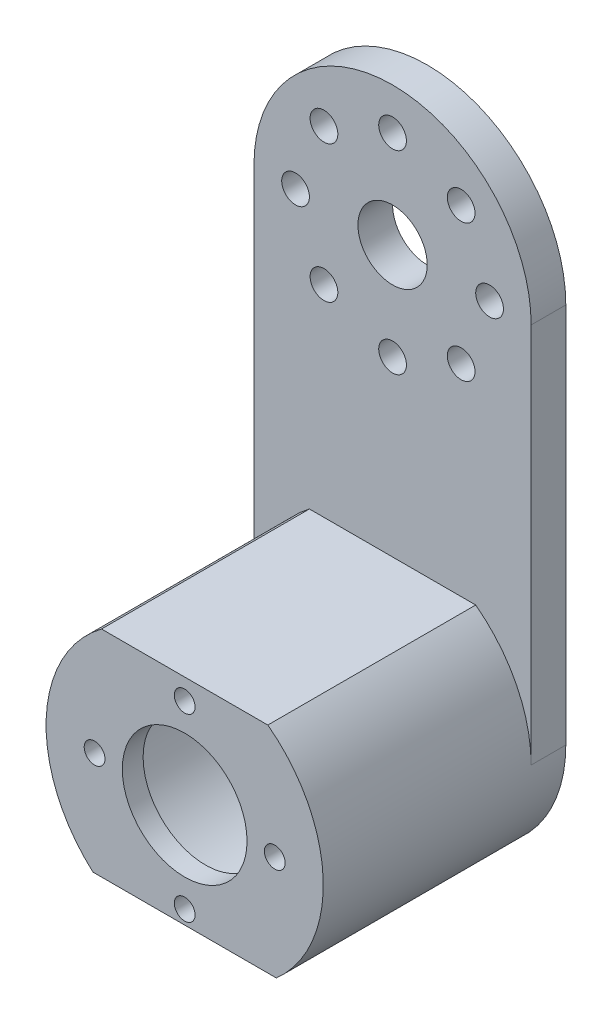
ISO-10303-21;
HEADER;
FILE_DESCRIPTION(('STEP AP214'),'2;1');
FILE_NAME('part.step','',(''),(''),'','','');
FILE_SCHEMA(('AUTOMOTIVE_DESIGN { 1 0 10303 214 1 1 1 1 }'));
ENDSEC;
DATA;
#1=APPLICATION_CONTEXT('core data for automotive mechanical design processes');
#2=APPLICATION_PROTOCOL_DEFINITION('international standard','automotive_design',2000,#1);
#3=PRODUCT_CONTEXT('',#1,'mechanical');
#4=PRODUCT('Part','Part','',(#3));
#5=PRODUCT_RELATED_PRODUCT_CATEGORY('part','',(#4));
#6=PRODUCT_DEFINITION_FORMATION('','',#4);
#7=PRODUCT_DEFINITION_CONTEXT('part definition',#1,'design');
#8=PRODUCT_DEFINITION('design','',#6,#7);
#9=PRODUCT_DEFINITION_SHAPE('','',#8);
#10=(LENGTH_UNIT() NAMED_UNIT(*) SI_UNIT(.MILLI.,.METRE.));
#11=(NAMED_UNIT(*) PLANE_ANGLE_UNIT() SI_UNIT($,.RADIAN.));
#12=(NAMED_UNIT(*) SI_UNIT($,.STERADIAN.) SOLID_ANGLE_UNIT());
#13=UNCERTAINTY_MEASURE_WITH_UNIT(LENGTH_MEASURE(1.E-05),#10,'distance_accuracy_value','');
#14=(GEOMETRIC_REPRESENTATION_CONTEXT(3) GLOBAL_UNCERTAINTY_ASSIGNED_CONTEXT((#13)) GLOBAL_UNIT_ASSIGNED_CONTEXT((#10,
#11,#12)) REPRESENTATION_CONTEXT('',''));
#15=CARTESIAN_POINT('',(0.,0.,0.));
#16=DIRECTION('',(0.,0.,1.));
#17=DIRECTION('',(1.,0.,0.));
#18=AXIS2_PLACEMENT_3D('',#15,#16,#17);
#19=CARTESIAN_POINT('',(0.,-75.,35.));
#20=DIRECTION('',(0.,0.,-1.));
#21=DIRECTION('',(-1.,0.,0.));
#22=AXIS2_PLACEMENT_3D('',#19,#20,#21);
#23=CYLINDRICAL_SURFACE('',#22,8.99999999999999);
#24=CARTESIAN_POINT('',(0.,-75.,35.));
#25=DIRECTION('',(0.,0.,1.));
#26=DIRECTION('',(1.,0.,0.));
#27=AXIS2_PLACEMENT_3D('',#24,#25,#26);
#28=CIRCLE('',#27,8.99999999999999);
#29=CARTESIAN_POINT('',(8.99999999999999,-75.,35.));
#30=VERTEX_POINT('',#29);
#31=EDGE_CURVE('E107',#30,#30,#28,.T.);
#32=ORIENTED_EDGE('',*,*,#31,.T.);
#33=EDGE_LOOP('',(#32));
#34=FACE_BOUND('',#33,.T.);
#35=CARTESIAN_POINT('',(0.,-75.,32.));
#36=DIRECTION('',(0.,0.,-1.));
#37=DIRECTION('',(-1.,0.,0.));
#38=AXIS2_PLACEMENT_3D('',#35,#36,#37);
#39=CIRCLE('',#38,8.99999999999999);
#40=CARTESIAN_POINT('',(-8.99999999999999,-75.,32.));
#41=VERTEX_POINT('',#40);
#42=EDGE_CURVE('E166',#41,#41,#39,.T.);
#43=ORIENTED_EDGE('',*,*,#42,.T.);
#44=EDGE_LOOP('',(#43));
#45=FACE_BOUND('',#44,.T.);
#46=ADVANCED_FACE('F30',(#34,#45),#23,.F.);
#47=CARTESIAN_POINT('',(0.,-62.,35.));
#48=DIRECTION('',(0.,0.,-1.));
#49=DIRECTION('',(-1.,0.,0.));
#50=AXIS2_PLACEMENT_3D('',#47,#48,#49);
#51=CYLINDRICAL_SURFACE('',#50,1.5);
#52=CARTESIAN_POINT('',(0.,-62.,35.));
#53=DIRECTION('',(0.,0.,1.));
#54=DIRECTION('',(1.,0.,0.));
#55=AXIS2_PLACEMENT_3D('',#52,#53,#54);
#56=CIRCLE('',#55,1.5);
#57=CARTESIAN_POINT('',(1.5,-62.,35.));
#58=VERTEX_POINT('',#57);
#59=EDGE_CURVE('E177',#58,#58,#56,.T.);
#60=ORIENTED_EDGE('',*,*,#59,.T.);
#61=EDGE_LOOP('',(#60));
#62=FACE_BOUND('',#61,.T.);
#63=CARTESIAN_POINT('',(0.,-62.,32.));
#64=DIRECTION('',(0.,0.,-1.));
#65=DIRECTION('',(-1.,0.,0.));
#66=AXIS2_PLACEMENT_3D('',#63,#64,#65);
#67=CIRCLE('',#66,1.5);
#68=CARTESIAN_POINT('',(-1.5,-62.,32.));
#69=VERTEX_POINT('',#68);
#70=EDGE_CURVE('E163',#69,#69,#67,.T.);
#71=ORIENTED_EDGE('',*,*,#70,.T.);
#72=EDGE_LOOP('',(#71));
#73=FACE_BOUND('',#72,.T.);
#74=ADVANCED_FACE('F211',(#62,#73),#51,.F.);
#75=CARTESIAN_POINT('',(0.,-88.,35.));
#76=DIRECTION('',(0.,0.,-1.));
#77=DIRECTION('',(-1.,0.,0.));
#78=AXIS2_PLACEMENT_3D('',#75,#76,#77);
#79=CYLINDRICAL_SURFACE('',#78,1.5);
#80=CARTESIAN_POINT('',(0.,-88.,35.));
#81=DIRECTION('',(0.,0.,1.));
#82=DIRECTION('',(1.,0.,0.));
#83=AXIS2_PLACEMENT_3D('',#80,#81,#82);
#84=CIRCLE('',#83,1.5);
#85=CARTESIAN_POINT('',(1.5,-88.,35.));
#86=VERTEX_POINT('',#85);
#87=EDGE_CURVE('E175',#86,#86,#84,.T.);
#88=ORIENTED_EDGE('',*,*,#87,.T.);
#89=EDGE_LOOP('',(#88));
#90=FACE_BOUND('',#89,.T.);
#91=CARTESIAN_POINT('',(0.,-88.,32.));
#92=DIRECTION('',(0.,0.,-1.));
#93=DIRECTION('',(-1.,0.,0.));
#94=AXIS2_PLACEMENT_3D('',#91,#92,#93);
#95=CIRCLE('',#94,1.5);
#96=CARTESIAN_POINT('',(-1.5,-88.,32.));
#97=VERTEX_POINT('',#96);
#98=EDGE_CURVE('E154',#97,#97,#95,.T.);
#99=ORIENTED_EDGE('',*,*,#98,.T.);
#100=EDGE_LOOP('',(#99));
#101=FACE_BOUND('',#100,.T.);
#102=ADVANCED_FACE('F206',(#90,#101),#79,.F.);
#103=CARTESIAN_POINT('',(-13.,-75.,35.));
#104=DIRECTION('',(0.,0.,-1.));
#105=DIRECTION('',(-1.,0.,0.));
#106=AXIS2_PLACEMENT_3D('',#103,#104,#105);
#107=CYLINDRICAL_SURFACE('',#106,1.5);
#108=CARTESIAN_POINT('',(-13.,-75.,35.));
#109=DIRECTION('',(0.,0.,1.));
#110=DIRECTION('',(1.,0.,0.));
#111=AXIS2_PLACEMENT_3D('',#108,#109,#110);
#112=CIRCLE('',#111,1.5);
#113=CARTESIAN_POINT('',(-11.5,-75.,35.));
#114=VERTEX_POINT('',#113);
#115=EDGE_CURVE('E172',#114,#114,#112,.T.);
#116=ORIENTED_EDGE('',*,*,#115,.T.);
#117=EDGE_LOOP('',(#116));
#118=FACE_BOUND('',#117,.T.);
#119=CARTESIAN_POINT('',(-13.,-75.,32.));
#120=DIRECTION('',(0.,0.,-1.));
#121=DIRECTION('',(-1.,0.,0.));
#122=AXIS2_PLACEMENT_3D('',#119,#120,#121);
#123=CIRCLE('',#122,1.5);
#124=CARTESIAN_POINT('',(-14.5,-75.,32.));
#125=VERTEX_POINT('',#124);
#126=EDGE_CURVE('E150',#125,#125,#123,.T.);
#127=ORIENTED_EDGE('',*,*,#126,.T.);
#128=EDGE_LOOP('',(#127));
#129=FACE_BOUND('',#128,.T.);
#130=ADVANCED_FACE('F198',(#118,#129),#107,.F.);
#131=CARTESIAN_POINT('',(13.,-75.,35.));
#132=DIRECTION('',(0.,0.,-1.));
#133=DIRECTION('',(-1.,0.,0.));
#134=AXIS2_PLACEMENT_3D('',#131,#132,#133);
#135=CYLINDRICAL_SURFACE('',#134,1.5);
#136=CARTESIAN_POINT('',(13.,-75.,35.));
#137=DIRECTION('',(0.,0.,1.));
#138=DIRECTION('',(1.,0.,0.));
#139=AXIS2_PLACEMENT_3D('',#136,#137,#138);
#140=CIRCLE('',#139,1.5);
#141=CARTESIAN_POINT('',(14.5,-75.,35.));
#142=VERTEX_POINT('',#141);
#143=EDGE_CURVE('E169',#142,#142,#140,.T.);
#144=ORIENTED_EDGE('',*,*,#143,.T.);
#145=EDGE_LOOP('',(#144));
#146=FACE_BOUND('',#145,.T.);
#147=CARTESIAN_POINT('',(13.,-75.,32.));
#148=DIRECTION('',(0.,0.,-1.));
#149=DIRECTION('',(-1.,0.,0.));
#150=AXIS2_PLACEMENT_3D('',#147,#148,#149);
#151=CIRCLE('',#150,1.5);
#152=CARTESIAN_POINT('',(11.5,-75.,32.));
#153=VERTEX_POINT('',#152);
#154=EDGE_CURVE('E148',#153,#153,#151,.T.);
#155=ORIENTED_EDGE('',*,*,#154,.T.);
#156=EDGE_LOOP('',(#155));
#157=FACE_BOUND('',#156,.T.);
#158=ADVANCED_FACE('F195',(#146,#157),#135,.F.);
#159=CARTESIAN_POINT('',(0.,-20.,5.));
#160=DIRECTION('',(0.,0.,1.));
#161=DIRECTION('',(1.,0.,0.));
#162=AXIS2_PLACEMENT_3D('',#159,#160,#161);
#163=PLANE('',#162);
#164=CARTESIAN_POINT('',(0.,-75.,5.));
#165=DIRECTION('',(0.,0.,1.));
#166=DIRECTION('',(1.,0.,0.));
#167=AXIS2_PLACEMENT_3D('',#164,#165,#166);
#168=CIRCLE('',#167,20.);
#169=CARTESIAN_POINT('',(-12.,-59.,5.));
#170=VERTEX_POINT('',#169);
#171=CARTESIAN_POINT('',(-20.,-75.,5.));
#172=VERTEX_POINT('',#171);
#173=EDGE_CURVE('E111',#170,#172,#168,.T.);
#174=ORIENTED_EDGE('',*,*,#173,.F.);
#175=DIRECTION('',(-1.,0.,0.));
#176=VECTOR('',#175,1.);
#177=CARTESIAN_POINT('',(12.,-59.,5.));
#178=LINE('',#177,#176);
#179=CARTESIAN_POINT('',(12.,-59.,5.));
#180=VERTEX_POINT('',#179);
#181=EDGE_CURVE('E51',#180,#170,#178,.T.);
#182=ORIENTED_EDGE('',*,*,#181,.F.);
#183=CARTESIAN_POINT('',(20.,-75.,5.));
#184=VERTEX_POINT('',#183);
#185=EDGE_CURVE('E38',#184,#180,#168,.T.);
#186=ORIENTED_EDGE('',*,*,#185,.F.);
#187=DIRECTION('',(0.,1.,0.));
#188=VECTOR('',#187,1.);
#189=CARTESIAN_POINT('',(20.,-20.,5.));
#190=LINE('',#189,#188);
#191=CARTESIAN_POINT('',(20.,-20.,5.));
#192=VERTEX_POINT('',#191);
#193=EDGE_CURVE('E136',#184,#192,#190,.T.);
#194=ORIENTED_EDGE('',*,*,#193,.T.);
#195=CARTESIAN_POINT('',(0.,-20.,5.));
#196=DIRECTION('',(0.,0.,1.));
#197=DIRECTION('',(1.,0.,0.));
#198=AXIS2_PLACEMENT_3D('',#195,#196,#197);
#199=CIRCLE('',#198,20.);
#200=CARTESIAN_POINT('',(-20.,-20.,5.));
#201=VERTEX_POINT('',#200);
#202=EDGE_CURVE('E142',#192,#201,#199,.T.);
#203=ORIENTED_EDGE('',*,*,#202,.T.);
#204=DIRECTION('',(0.,-1.,0.));
#205=VECTOR('',#204,1.);
#206=CARTESIAN_POINT('',(-20.,-20.,5.));
#207=LINE('',#206,#205);
#208=EDGE_CURVE('E138',#201,#172,#207,.T.);
#209=ORIENTED_EDGE('',*,*,#208,.T.);
#210=EDGE_LOOP('',(#174,#182,#186,#194,#203,#209));
#211=FACE_BOUND('',#210,.T.);
#212=CARTESIAN_POINT('',(-1.42247325030098E-13,-34.,5.));
#213=DIRECTION('',(0.,0.,1.));
#214=DIRECTION('',(1.,0.,0.));
#215=AXIS2_PLACEMENT_3D('',#212,#213,#214);
#216=CIRCLE('',#215,2.);
#217=CARTESIAN_POINT('',(1.99999999999985,-34.,5.));
#218=VERTEX_POINT('',#217);
#219=EDGE_CURVE('E345',#218,#218,#216,.T.);
#220=ORIENTED_EDGE('',*,*,#219,.F.);
#221=EDGE_LOOP('',(#220));
#222=FACE_BOUND('',#221,.T.);
#223=CARTESIAN_POINT('',(14.,-20.0000000000001,5.));
#224=DIRECTION('',(0.,0.,1.));
#225=DIRECTION('',(1.,0.,0.));
#226=AXIS2_PLACEMENT_3D('',#223,#224,#225);
#227=CIRCLE('',#226,2.);
#228=CARTESIAN_POINT('',(16.,-20.0000000000001,5.));
#229=VERTEX_POINT('',#228);
#230=EDGE_CURVE('E333',#229,#229,#227,.T.);
#231=ORIENTED_EDGE('',*,*,#230,.F.);
#232=EDGE_LOOP('',(#231));
#233=FACE_BOUND('',#232,.T.);
#234=CARTESIAN_POINT('',(0.,-6.,5.));
#235=DIRECTION('',(0.,0.,1.));
#236=DIRECTION('',(1.,0.,0.));
#237=AXIS2_PLACEMENT_3D('',#234,#235,#236);
#238=CIRCLE('',#237,2.);
#239=CARTESIAN_POINT('',(2.00000000000005,-6.,5.));
#240=VERTEX_POINT('',#239);
#241=EDGE_CURVE('E321',#240,#240,#238,.T.);
#242=ORIENTED_EDGE('',*,*,#241,.F.);
#243=EDGE_LOOP('',(#242));
#244=FACE_BOUND('',#243,.T.);
#245=CARTESIAN_POINT('',(-14.,-20.,5.));
#246=DIRECTION('',(0.,0.,1.));
#247=DIRECTION('',(1.,0.,0.));
#248=AXIS2_PLACEMENT_3D('',#245,#246,#247);
#249=CIRCLE('',#248,2.);
#250=CARTESIAN_POINT('',(-12.,-20.,5.));
#251=VERTEX_POINT('',#250);
#252=EDGE_CURVE('E309',#251,#251,#249,.T.);
#253=ORIENTED_EDGE('',*,*,#252,.F.);
#254=EDGE_LOOP('',(#253));
#255=FACE_BOUND('',#254,.T.);
#256=CARTESIAN_POINT('',(0.,-20.,5.));
#257=DIRECTION('',(0.,0.,1.));
#258=DIRECTION('',(1.,0.,0.));
#259=AXIS2_PLACEMENT_3D('',#256,#257,#258);
#260=CIRCLE('',#259,5.);
#261=CARTESIAN_POINT('',(5.,-20.,5.));
#262=VERTEX_POINT('',#261);
#263=EDGE_CURVE('E302',#262,#262,#260,.T.);
#264=ORIENTED_EDGE('',*,*,#263,.F.);
#265=EDGE_LOOP('',(#264));
#266=FACE_BOUND('',#265,.T.);
#267=CARTESIAN_POINT('',(-9.89949493661165,-10.1005050633883,5.));
#268=DIRECTION('',(0.,0.,1.));
#269=DIRECTION('',(1.,0.,0.));
#270=AXIS2_PLACEMENT_3D('',#267,#268,#269);
#271=CIRCLE('',#270,2.);
#272=CARTESIAN_POINT('',(-7.89949493661165,-10.1005050633883,5.));
#273=VERTEX_POINT('',#272);
#274=EDGE_CURVE('E315',#273,#273,#271,.T.);
#275=ORIENTED_EDGE('',*,*,#274,.F.);
#276=EDGE_LOOP('',(#275));
#277=FACE_BOUND('',#276,.T.);
#278=CARTESIAN_POINT('',(9.89949493661171,-10.1005050633884,5.));
#279=DIRECTION('',(0.,0.,1.));
#280=DIRECTION('',(1.,0.,0.));
#281=AXIS2_PLACEMENT_3D('',#278,#279,#280);
#282=CIRCLE('',#281,2.);
#283=CARTESIAN_POINT('',(11.8994949366117,-10.1005050633884,5.));
#284=VERTEX_POINT('',#283);
#285=EDGE_CURVE('E327',#284,#284,#282,.T.);
#286=ORIENTED_EDGE('',*,*,#285,.F.);
#287=EDGE_LOOP('',(#286));
#288=FACE_BOUND('',#287,.T.);
#289=CARTESIAN_POINT('',(9.89949493661159,-29.8994949366118,5.));
#290=DIRECTION('',(0.,0.,1.));
#291=DIRECTION('',(1.,0.,0.));
#292=AXIS2_PLACEMENT_3D('',#289,#290,#291);
#293=CIRCLE('',#292,2.);
#294=CARTESIAN_POINT('',(11.8994949366116,-29.8994949366118,5.));
#295=VERTEX_POINT('',#294);
#296=EDGE_CURVE('E339',#295,#295,#293,.T.);
#297=ORIENTED_EDGE('',*,*,#296,.F.);
#298=EDGE_LOOP('',(#297));
#299=FACE_BOUND('',#298,.T.);
#300=CARTESIAN_POINT('',(-9.89949493661179,-29.8994949366115,5.));
#301=DIRECTION('',(0.,0.,1.));
#302=DIRECTION('',(1.,0.,0.));
#303=AXIS2_PLACEMENT_3D('',#300,#301,#302);
#304=CIRCLE('',#303,2.);
#305=CARTESIAN_POINT('',(-7.89949493661178,-29.8994949366115,5.));
#306=VERTEX_POINT('',#305);
#307=EDGE_CURVE('E120',#306,#306,#304,.T.);
#308=ORIENTED_EDGE('',*,*,#307,.F.);
#309=EDGE_LOOP('',(#308));
#310=FACE_BOUND('',#309,.T.);
#311=ADVANCED_FACE('F197',(#211,#222,#233,#244,#255,#266,#277,#288,#299,#310),#163,.T.);
#312=CARTESIAN_POINT('',(0.,-20.,0.));
#313=DIRECTION('',(0.,0.,1.));
#314=DIRECTION('',(1.,0.,0.));
#315=AXIS2_PLACEMENT_3D('',#312,#313,#314);
#316=PLANE('',#315);
#317=CARTESIAN_POINT('',(-1.42247325030098E-13,-34.,0.));
#318=DIRECTION('',(0.,0.,1.));
#319=DIRECTION('',(1.,0.,0.));
#320=AXIS2_PLACEMENT_3D('',#317,#318,#319);
#321=CIRCLE('',#320,2.);
#322=CARTESIAN_POINT('',(1.99999999999985,-34.,0.));
#323=VERTEX_POINT('',#322);
#324=EDGE_CURVE('E348',#323,#323,#321,.T.);
#325=ORIENTED_EDGE('',*,*,#324,.T.);
#326=EDGE_LOOP('',(#325));
#327=FACE_BOUND('',#326,.T.);
#328=CARTESIAN_POINT('',(14.,-20.0000000000001,0.));
#329=DIRECTION('',(0.,0.,1.));
#330=DIRECTION('',(1.,0.,0.));
#331=AXIS2_PLACEMENT_3D('',#328,#329,#330);
#332=CIRCLE('',#331,2.);
#333=CARTESIAN_POINT('',(16.,-20.0000000000001,0.));
#334=VERTEX_POINT('',#333);
#335=EDGE_CURVE('E336',#334,#334,#332,.T.);
#336=ORIENTED_EDGE('',*,*,#335,.T.);
#337=EDGE_LOOP('',(#336));
#338=FACE_BOUND('',#337,.T.);
#339=CARTESIAN_POINT('',(0.,-6.,0.));
#340=DIRECTION('',(0.,0.,1.));
#341=DIRECTION('',(1.,0.,0.));
#342=AXIS2_PLACEMENT_3D('',#339,#340,#341);
#343=CIRCLE('',#342,2.);
#344=CARTESIAN_POINT('',(2.00000000000005,-6.,0.));
#345=VERTEX_POINT('',#344);
#346=EDGE_CURVE('E324',#345,#345,#343,.T.);
#347=ORIENTED_EDGE('',*,*,#346,.T.);
#348=EDGE_LOOP('',(#347));
#349=FACE_BOUND('',#348,.T.);
#350=CARTESIAN_POINT('',(-14.,-20.,0.));
#351=DIRECTION('',(0.,0.,1.));
#352=DIRECTION('',(1.,0.,0.));
#353=AXIS2_PLACEMENT_3D('',#350,#351,#352);
#354=CIRCLE('',#353,2.);
#355=CARTESIAN_POINT('',(-12.,-20.,0.));
#356=VERTEX_POINT('',#355);
#357=EDGE_CURVE('E312',#356,#356,#354,.T.);
#358=ORIENTED_EDGE('',*,*,#357,.T.);
#359=EDGE_LOOP('',(#358));
#360=FACE_BOUND('',#359,.T.);
#361=CARTESIAN_POINT('',(0.,-75.,0.));
#362=DIRECTION('',(0.,0.,1.));
#363=DIRECTION('',(1.,0.,0.));
#364=AXIS2_PLACEMENT_3D('',#361,#362,#363);
#365=CIRCLE('',#364,15.);
#366=CARTESIAN_POINT('',(15.,-75.,0.));
#367=VERTEX_POINT('',#366);
#368=EDGE_CURVE('E300',#367,#367,#365,.T.);
#369=ORIENTED_EDGE('',*,*,#368,.T.);
#370=EDGE_LOOP('',(#369));
#371=FACE_BOUND('',#370,.T.);
#372=CARTESIAN_POINT('',(0.,-20.,0.));
#373=DIRECTION('',(0.,0.,1.));
#374=DIRECTION('',(1.,0.,0.));
#375=AXIS2_PLACEMENT_3D('',#372,#373,#374);
#376=CIRCLE('',#375,20.);
#377=CARTESIAN_POINT('',(20.,-20.,0.));
#378=VERTEX_POINT('',#377);
#379=CARTESIAN_POINT('',(-20.,-20.,0.));
#380=VERTEX_POINT('',#379);
#381=EDGE_CURVE('E286',#378,#380,#376,.T.);
#382=ORIENTED_EDGE('',*,*,#381,.F.);
#383=DIRECTION('',(0.,1.,0.));
#384=VECTOR('',#383,1.);
#385=CARTESIAN_POINT('',(20.,-20.,0.));
#386=LINE('',#385,#384);
#387=CARTESIAN_POINT('',(20.,-75.,0.));
#388=VERTEX_POINT('',#387);
#389=EDGE_CURVE('E291',#388,#378,#386,.T.);
#390=ORIENTED_EDGE('',*,*,#389,.F.);
#391=CARTESIAN_POINT('',(0.,-75.,0.));
#392=DIRECTION('',(0.,0.,1.));
#393=DIRECTION('',(1.,0.,0.));
#394=AXIS2_PLACEMENT_3D('',#391,#392,#393);
#395=CIRCLE('',#394,20.);
#396=CARTESIAN_POINT('',(-20.,-75.,0.));
#397=VERTEX_POINT('',#396);
#398=EDGE_CURVE('E285',#397,#388,#395,.T.);
#399=ORIENTED_EDGE('',*,*,#398,.F.);
#400=DIRECTION('',(0.,-1.,0.));
#401=VECTOR('',#400,1.);
#402=CARTESIAN_POINT('',(-20.,-20.,0.));
#403=LINE('',#402,#401);
#404=EDGE_CURVE('E279',#380,#397,#403,.T.);
#405=ORIENTED_EDGE('',*,*,#404,.F.);
#406=EDGE_LOOP('',(#382,#390,#399,#405));
#407=FACE_BOUND('',#406,.T.);
#408=CARTESIAN_POINT('',(0.,-20.,0.));
#409=DIRECTION('',(0.,0.,1.));
#410=DIRECTION('',(1.,0.,0.));
#411=AXIS2_PLACEMENT_3D('',#408,#409,#410);
#412=CIRCLE('',#411,5.);
#413=CARTESIAN_POINT('',(5.,-20.,0.));
#414=VERTEX_POINT('',#413);
#415=EDGE_CURVE('E306',#414,#414,#412,.T.);
#416=ORIENTED_EDGE('',*,*,#415,.T.);
#417=EDGE_LOOP('',(#416));
#418=FACE_BOUND('',#417,.T.);
#419=CARTESIAN_POINT('',(-9.89949493661165,-10.1005050633883,0.));
#420=DIRECTION('',(0.,0.,1.));
#421=DIRECTION('',(1.,0.,0.));
#422=AXIS2_PLACEMENT_3D('',#419,#420,#421);
#423=CIRCLE('',#422,2.);
#424=CARTESIAN_POINT('',(-7.89949493661165,-10.1005050633883,0.));
#425=VERTEX_POINT('',#424);
#426=EDGE_CURVE('E318',#425,#425,#423,.T.);
#427=ORIENTED_EDGE('',*,*,#426,.T.);
#428=EDGE_LOOP('',(#427));
#429=FACE_BOUND('',#428,.T.);
#430=CARTESIAN_POINT('',(9.89949493661171,-10.1005050633884,0.));
#431=DIRECTION('',(0.,0.,1.));
#432=DIRECTION('',(1.,0.,0.));
#433=AXIS2_PLACEMENT_3D('',#430,#431,#432);
#434=CIRCLE('',#433,2.);
#435=CARTESIAN_POINT('',(11.8994949366117,-10.1005050633884,0.));
#436=VERTEX_POINT('',#435);
#437=EDGE_CURVE('E330',#436,#436,#434,.T.);
#438=ORIENTED_EDGE('',*,*,#437,.T.);
#439=EDGE_LOOP('',(#438));
#440=FACE_BOUND('',#439,.T.);
#441=CARTESIAN_POINT('',(9.89949493661159,-29.8994949366118,0.));
#442=DIRECTION('',(0.,0.,1.));
#443=DIRECTION('',(1.,0.,0.));
#444=AXIS2_PLACEMENT_3D('',#441,#442,#443);
#445=CIRCLE('',#444,2.);
#446=CARTESIAN_POINT('',(11.8994949366116,-29.8994949366118,0.));
#447=VERTEX_POINT('',#446);
#448=EDGE_CURVE('E342',#447,#447,#445,.T.);
#449=ORIENTED_EDGE('',*,*,#448,.T.);
#450=EDGE_LOOP('',(#449));
#451=FACE_BOUND('',#450,.T.);
#452=CARTESIAN_POINT('',(-9.89949493661179,-29.8994949366115,0.));
#453=DIRECTION('',(0.,0.,1.));
#454=DIRECTION('',(1.,0.,0.));
#455=AXIS2_PLACEMENT_3D('',#452,#453,#454);
#456=CIRCLE('',#455,2.);
#457=CARTESIAN_POINT('',(-7.89949493661178,-29.8994949366115,0.));
#458=VERTEX_POINT('',#457);
#459=EDGE_CURVE('E116',#458,#458,#456,.T.);
#460=ORIENTED_EDGE('',*,*,#459,.T.);
#461=EDGE_LOOP('',(#460));
#462=FACE_BOUND('',#461,.T.);
#463=ADVANCED_FACE('F204',(#327,#338,#349,#360,#371,#407,#418,#429,#440,#451,#462),#316,.F.);
#464=CARTESIAN_POINT('',(0.,-20.,5.));
#465=DIRECTION('',(0.,0.,-1.));
#466=DIRECTION('',(-1.,0.,0.));
#467=AXIS2_PLACEMENT_3D('',#464,#465,#466);
#468=CYLINDRICAL_SURFACE('',#467,20.);
#469=ORIENTED_EDGE('',*,*,#381,.T.);
#470=DIRECTION('',(0.,0.,-1.));
#471=VECTOR('',#470,1.);
#472=CARTESIAN_POINT('',(-20.,-20.,5.));
#473=LINE('',#472,#471);
#474=EDGE_CURVE('E125',#201,#380,#473,.T.);
#475=ORIENTED_EDGE('',*,*,#474,.F.);
#476=ORIENTED_EDGE('',*,*,#202,.F.);
#477=DIRECTION('',(0.,0.,-1.));
#478=VECTOR('',#477,1.);
#479=CARTESIAN_POINT('',(20.,-20.,5.));
#480=LINE('',#479,#478);
#481=EDGE_CURVE('E133',#192,#378,#480,.T.);
#482=ORIENTED_EDGE('',*,*,#481,.T.);
#483=EDGE_LOOP('',(#469,#475,#476,#482));
#484=FACE_BOUND('',#483,.T.);
#485=ADVANCED_FACE('F32',(#484),#468,.T.);
#486=CARTESIAN_POINT('',(-20.,-20.,5.));
#487=DIRECTION('',(1.,0.,0.));
#488=DIRECTION('',(0.,1.,0.));
#489=AXIS2_PLACEMENT_3D('',#486,#487,#488);
#490=PLANE('',#489);
#491=ORIENTED_EDGE('',*,*,#404,.T.);
#492=DIRECTION('',(0.,0.,-1.));
#493=VECTOR('',#492,1.);
#494=CARTESIAN_POINT('',(-20.,-75.,5.));
#495=LINE('',#494,#493);
#496=EDGE_CURVE('E132',#172,#397,#495,.T.);
#497=ORIENTED_EDGE('',*,*,#496,.F.);
#498=ORIENTED_EDGE('',*,*,#208,.F.);
#499=ORIENTED_EDGE('',*,*,#474,.T.);
#500=EDGE_LOOP('',(#491,#497,#498,#499));
#501=FACE_BOUND('',#500,.T.);
#502=ADVANCED_FACE('F270',(#501),#490,.F.);
#503=CARTESIAN_POINT('',(0.,-75.,5.));
#504=DIRECTION('',(0.,0.,-1.));
#505=DIRECTION('',(-1.,0.,0.));
#506=AXIS2_PLACEMENT_3D('',#503,#504,#505);
#507=CYLINDRICAL_SURFACE('',#506,20.);
#508=CARTESIAN_POINT('',(0.,-75.,50.));
#509=DIRECTION('',(0.,0.707106781186547,-0.707106781186548));
#510=DIRECTION('',(0.,-0.707106781186548,-0.707106781186547));
#511=AXIS2_PLACEMENT_3D('',#508,#509,#510);
#512=ELLIPSE('',#511,28.2842712474619,20.);
#513=CARTESIAN_POINT('',(13.228756555323,-90.,35.));
#514=VERTEX_POINT('',#513);
#515=CARTESIAN_POINT('',(-13.228756555323,-90.,35.));
#516=VERTEX_POINT('',#515);
#517=EDGE_CURVE('E43',#514,#516,#512,.T.);
#518=ORIENTED_EDGE('',*,*,#517,.T.);
#519=CARTESIAN_POINT('',(0.,-75.,35.));
#520=DIRECTION('',(0.,0.,1.));
#521=DIRECTION('',(1.,0.,0.));
#522=AXIS2_PLACEMENT_3D('',#519,#520,#521);
#523=CIRCLE('',#522,20.);
#524=CARTESIAN_POINT('',(-12.,-59.,35.));
#525=VERTEX_POINT('',#524);
#526=EDGE_CURVE('E91',#525,#516,#523,.T.);
#527=ORIENTED_EDGE('',*,*,#526,.F.);
#528=DIRECTION('',(0.,0.,-1.));
#529=VECTOR('',#528,1.);
#530=CARTESIAN_POINT('',(-12.,-59.,35.));
#531=LINE('',#530,#529);
#532=EDGE_CURVE('E104',#525,#170,#531,.T.);
#533=ORIENTED_EDGE('',*,*,#532,.T.);
#534=ORIENTED_EDGE('',*,*,#173,.T.);
#535=ORIENTED_EDGE('',*,*,#496,.T.);
#536=ORIENTED_EDGE('',*,*,#398,.T.);
#537=DIRECTION('',(0.,0.,-1.));
#538=VECTOR('',#537,1.);
#539=CARTESIAN_POINT('',(20.,-75.,5.));
#540=LINE('',#539,#538);
#541=EDGE_CURVE('E129',#184,#388,#540,.T.);
#542=ORIENTED_EDGE('',*,*,#541,.F.);
#543=ORIENTED_EDGE('',*,*,#185,.T.);
#544=DIRECTION('',(0.,0.,-1.));
#545=VECTOR('',#544,1.);
#546=CARTESIAN_POINT('',(12.,-59.,35.));
#547=LINE('',#546,#545);
#548=CARTESIAN_POINT('',(12.,-59.,35.));
#549=VERTEX_POINT('',#548);
#550=EDGE_CURVE('E113',#549,#180,#547,.T.);
#551=ORIENTED_EDGE('',*,*,#550,.F.);
#552=EDGE_CURVE('E93',#514,#549,#523,.T.);
#553=ORIENTED_EDGE('',*,*,#552,.F.);
#554=EDGE_LOOP('',(#518,#527,#533,#534,#535,#536,#542,#543,#551,#553));
#555=FACE_BOUND('',#554,.T.);
#556=ADVANCED_FACE('F88',(#555),#507,.T.);
#557=CARTESIAN_POINT('',(20.,-20.,5.));
#558=DIRECTION('',(-1.,0.,0.));
#559=DIRECTION('',(0.,-1.,0.));
#560=AXIS2_PLACEMENT_3D('',#557,#558,#559);
#561=PLANE('',#560);
#562=ORIENTED_EDGE('',*,*,#389,.T.);
#563=ORIENTED_EDGE('',*,*,#481,.F.);
#564=ORIENTED_EDGE('',*,*,#193,.F.);
#565=ORIENTED_EDGE('',*,*,#541,.T.);
#566=EDGE_LOOP('',(#562,#563,#564,#565));
#567=FACE_BOUND('',#566,.T.);
#568=ADVANCED_FACE('F260',(#567),#561,.F.);
#569=CARTESIAN_POINT('',(0.,-75.,5.));
#570=DIRECTION('',(0.,0.,-1.));
#571=DIRECTION('',(-1.,0.,0.));
#572=AXIS2_PLACEMENT_3D('',#569,#570,#571);
#573=CYLINDRICAL_SURFACE('',#572,15.);
#574=ORIENTED_EDGE('',*,*,#368,.F.);
#575=EDGE_LOOP('',(#574));
#576=FACE_BOUND('',#575,.T.);
#577=CARTESIAN_POINT('',(0.,-75.,32.));
#578=DIRECTION('',(0.,0.,-1.));
#579=DIRECTION('',(-1.,0.,0.));
#580=AXIS2_PLACEMENT_3D('',#577,#578,#579);
#581=CIRCLE('',#580,15.);
#582=CARTESIAN_POINT('',(-15.,-75.,32.));
#583=VERTEX_POINT('',#582);
#584=EDGE_CURVE('E94',#583,#583,#581,.T.);
#585=ORIENTED_EDGE('',*,*,#584,.F.);
#586=EDGE_LOOP('',(#585));
#587=FACE_BOUND('',#586,.T.);
#588=ADVANCED_FACE('F257',(#576,#587),#573,.F.);
#589=CARTESIAN_POINT('',(0.,-20.,5.));
#590=DIRECTION('',(0.,0.,-1.));
#591=DIRECTION('',(-1.,0.,0.));
#592=AXIS2_PLACEMENT_3D('',#589,#590,#591);
#593=CYLINDRICAL_SURFACE('',#592,5.);
#594=ORIENTED_EDGE('',*,*,#263,.T.);
#595=EDGE_LOOP('',(#594));
#596=FACE_BOUND('',#595,.T.);
#597=ORIENTED_EDGE('',*,*,#415,.F.);
#598=EDGE_LOOP('',(#597));
#599=FACE_BOUND('',#598,.T.);
#600=ADVANCED_FACE('F253',(#596,#599),#593,.F.);
#601=CARTESIAN_POINT('',(-14.,-20.,5.));
#602=DIRECTION('',(0.,0.,-1.));
#603=DIRECTION('',(-1.,0.,0.));
#604=AXIS2_PLACEMENT_3D('',#601,#602,#603);
#605=CYLINDRICAL_SURFACE('',#604,2.);
#606=ORIENTED_EDGE('',*,*,#252,.T.);
#607=EDGE_LOOP('',(#606));
#608=FACE_BOUND('',#607,.T.);
#609=ORIENTED_EDGE('',*,*,#357,.F.);
#610=EDGE_LOOP('',(#609));
#611=FACE_BOUND('',#610,.T.);
#612=ADVANCED_FACE('F249',(#608,#611),#605,.F.);
#613=CARTESIAN_POINT('',(-9.89949493661165,-10.1005050633883,5.));
#614=DIRECTION('',(0.,0.,-1.));
#615=DIRECTION('',(-1.,0.,0.));
#616=AXIS2_PLACEMENT_3D('',#613,#614,#615);
#617=CYLINDRICAL_SURFACE('',#616,2.);
#618=ORIENTED_EDGE('',*,*,#274,.T.);
#619=EDGE_LOOP('',(#618));
#620=FACE_BOUND('',#619,.T.);
#621=ORIENTED_EDGE('',*,*,#426,.F.);
#622=EDGE_LOOP('',(#621));
#623=FACE_BOUND('',#622,.T.);
#624=ADVANCED_FACE('F245',(#620,#623),#617,.F.);
#625=CARTESIAN_POINT('',(0.,-6.,5.));
#626=DIRECTION('',(0.,0.,-1.));
#627=DIRECTION('',(-1.,0.,0.));
#628=AXIS2_PLACEMENT_3D('',#625,#626,#627);
#629=CYLINDRICAL_SURFACE('',#628,2.);
#630=ORIENTED_EDGE('',*,*,#241,.T.);
#631=EDGE_LOOP('',(#630));
#632=FACE_BOUND('',#631,.T.);
#633=ORIENTED_EDGE('',*,*,#346,.F.);
#634=EDGE_LOOP('',(#633));
#635=FACE_BOUND('',#634,.T.);
#636=ADVANCED_FACE('F241',(#632,#635),#629,.F.);
#637=CARTESIAN_POINT('',(9.89949493661171,-10.1005050633884,5.));
#638=DIRECTION('',(0.,0.,-1.));
#639=DIRECTION('',(-1.,0.,0.));
#640=AXIS2_PLACEMENT_3D('',#637,#638,#639);
#641=CYLINDRICAL_SURFACE('',#640,2.);
#642=ORIENTED_EDGE('',*,*,#285,.T.);
#643=EDGE_LOOP('',(#642));
#644=FACE_BOUND('',#643,.T.);
#645=ORIENTED_EDGE('',*,*,#437,.F.);
#646=EDGE_LOOP('',(#645));
#647=FACE_BOUND('',#646,.T.);
#648=ADVANCED_FACE('F237',(#644,#647),#641,.F.);
#649=CARTESIAN_POINT('',(14.,-20.0000000000001,5.));
#650=DIRECTION('',(0.,0.,-1.));
#651=DIRECTION('',(-1.,0.,0.));
#652=AXIS2_PLACEMENT_3D('',#649,#650,#651);
#653=CYLINDRICAL_SURFACE('',#652,2.);
#654=ORIENTED_EDGE('',*,*,#230,.T.);
#655=EDGE_LOOP('',(#654));
#656=FACE_BOUND('',#655,.T.);
#657=ORIENTED_EDGE('',*,*,#335,.F.);
#658=EDGE_LOOP('',(#657));
#659=FACE_BOUND('',#658,.T.);
#660=ADVANCED_FACE('F233',(#656,#659),#653,.F.);
#661=CARTESIAN_POINT('',(9.89949493661159,-29.8994949366118,5.));
#662=DIRECTION('',(0.,0.,-1.));
#663=DIRECTION('',(-1.,0.,0.));
#664=AXIS2_PLACEMENT_3D('',#661,#662,#663);
#665=CYLINDRICAL_SURFACE('',#664,2.);
#666=ORIENTED_EDGE('',*,*,#296,.T.);
#667=EDGE_LOOP('',(#666));
#668=FACE_BOUND('',#667,.T.);
#669=ORIENTED_EDGE('',*,*,#448,.F.);
#670=EDGE_LOOP('',(#669));
#671=FACE_BOUND('',#670,.T.);
#672=ADVANCED_FACE('F229',(#668,#671),#665,.F.);
#673=CARTESIAN_POINT('',(-1.42247325030098E-13,-34.,5.));
#674=DIRECTION('',(0.,0.,-1.));
#675=DIRECTION('',(-1.,0.,0.));
#676=AXIS2_PLACEMENT_3D('',#673,#674,#675);
#677=CYLINDRICAL_SURFACE('',#676,2.);
#678=ORIENTED_EDGE('',*,*,#219,.T.);
#679=EDGE_LOOP('',(#678));
#680=FACE_BOUND('',#679,.T.);
#681=ORIENTED_EDGE('',*,*,#324,.F.);
#682=EDGE_LOOP('',(#681));
#683=FACE_BOUND('',#682,.T.);
#684=ADVANCED_FACE('F225',(#680,#683),#677,.F.);
#685=CARTESIAN_POINT('',(-9.89949493661179,-29.8994949366115,5.));
#686=DIRECTION('',(0.,0.,-1.));
#687=DIRECTION('',(-1.,0.,0.));
#688=AXIS2_PLACEMENT_3D('',#685,#686,#687);
#689=CYLINDRICAL_SURFACE('',#688,2.);
#690=ORIENTED_EDGE('',*,*,#307,.T.);
#691=EDGE_LOOP('',(#690));
#692=FACE_BOUND('',#691,.T.);
#693=ORIENTED_EDGE('',*,*,#459,.F.);
#694=EDGE_LOOP('',(#693));
#695=FACE_BOUND('',#694,.T.);
#696=ADVANCED_FACE('F189',(#692,#695),#689,.F.);
#697=CARTESIAN_POINT('',(0.,-75.,35.));
#698=DIRECTION('',(0.,0.,1.));
#699=DIRECTION('',(1.,0.,0.));
#700=AXIS2_PLACEMENT_3D('',#697,#698,#699);
#701=PLANE('',#700);
#702=DIRECTION('',(-1.,0.,0.));
#703=VECTOR('',#702,1.);
#704=CARTESIAN_POINT('',(0.,-90.,35.));
#705=LINE('',#704,#703);
#706=EDGE_CURVE('E11',#514,#516,#705,.T.);
#707=ORIENTED_EDGE('',*,*,#706,.F.);
#708=ORIENTED_EDGE('',*,*,#552,.T.);
#709=DIRECTION('',(-1.,0.,0.));
#710=VECTOR('',#709,1.);
#711=CARTESIAN_POINT('',(12.,-59.,35.));
#712=LINE('',#711,#710);
#713=EDGE_CURVE('E101',#549,#525,#712,.T.);
#714=ORIENTED_EDGE('',*,*,#713,.T.);
#715=ORIENTED_EDGE('',*,*,#526,.T.);
#716=EDGE_LOOP('',(#707,#708,#714,#715));
#717=FACE_BOUND('',#716,.T.);
#718=ORIENTED_EDGE('',*,*,#115,.F.);
#719=EDGE_LOOP('',(#718));
#720=FACE_BOUND('',#719,.T.);
#721=ORIENTED_EDGE('',*,*,#59,.F.);
#722=EDGE_LOOP('',(#721));
#723=FACE_BOUND('',#722,.T.);
#724=ORIENTED_EDGE('',*,*,#31,.F.);
#725=EDGE_LOOP('',(#724));
#726=FACE_BOUND('',#725,.T.);
#727=ORIENTED_EDGE('',*,*,#87,.F.);
#728=EDGE_LOOP('',(#727));
#729=FACE_BOUND('',#728,.T.);
#730=ORIENTED_EDGE('',*,*,#143,.F.);
#731=EDGE_LOOP('',(#730));
#732=FACE_BOUND('',#731,.T.);
#733=ADVANCED_FACE('F98',(#717,#720,#723,#726,#729,#732),#701,.T.);
#734=CARTESIAN_POINT('',(12.,-59.,35.));
#735=DIRECTION('',(0.,-1.,0.));
#736=DIRECTION('',(1.,0.,0.));
#737=AXIS2_PLACEMENT_3D('',#734,#735,#736);
#738=PLANE('',#737);
#739=ORIENTED_EDGE('',*,*,#181,.T.);
#740=ORIENTED_EDGE('',*,*,#532,.F.);
#741=ORIENTED_EDGE('',*,*,#713,.F.);
#742=ORIENTED_EDGE('',*,*,#550,.T.);
#743=EDGE_LOOP('',(#739,#740,#741,#742));
#744=FACE_BOUND('',#743,.T.);
#745=ADVANCED_FACE('F188',(#744),#738,.F.);
#746=CARTESIAN_POINT('',(0.,-75.,32.));
#747=DIRECTION('',(0.,0.,-1.));
#748=DIRECTION('',(-1.,0.,0.));
#749=AXIS2_PLACEMENT_3D('',#746,#747,#748);
#750=PLANE('',#749);
#751=ORIENTED_EDGE('',*,*,#42,.F.);
#752=EDGE_LOOP('',(#751));
#753=FACE_BOUND('',#752,.T.);
#754=ORIENTED_EDGE('',*,*,#70,.F.);
#755=EDGE_LOOP('',(#754));
#756=FACE_BOUND('',#755,.T.);
#757=ORIENTED_EDGE('',*,*,#98,.F.);
#758=EDGE_LOOP('',(#757));
#759=FACE_BOUND('',#758,.T.);
#760=ORIENTED_EDGE('',*,*,#126,.F.);
#761=EDGE_LOOP('',(#760));
#762=FACE_BOUND('',#761,.T.);
#763=ORIENTED_EDGE('',*,*,#154,.F.);
#764=EDGE_LOOP('',(#763));
#765=FACE_BOUND('',#764,.T.);
#766=ORIENTED_EDGE('',*,*,#584,.T.);
#767=EDGE_LOOP('',(#766));
#768=FACE_BOUND('',#767,.T.);
#769=ADVANCED_FACE('F221',(#753,#756,#759,#762,#765,#768),#750,.T.);
#770=CARTESIAN_POINT('',(-20.00005,-90.,35.));
#771=DIRECTION('',(0.,0.707106781186547,-0.707106781186548));
#772=DIRECTION('',(0.,0.707106781186548,0.707106781186547));
#773=AXIS2_PLACEMENT_3D('',#770,#771,#772);
#774=PLANE('',#773);
#775=ORIENTED_EDGE('',*,*,#517,.F.);
#776=ORIENTED_EDGE('',*,*,#706,.T.);
#777=EDGE_LOOP('',(#775,#776));
#778=FACE_BOUND('',#777,.T.);
#779=ADVANCED_FACE('F96',(#778),#774,.F.);
#780=CLOSED_SHELL('',(#46,#74,#102,#130,#158,#311,#463,#485,#502,#556,#568,#588,#600,#612,#624,
#636,#648,#660,#672,#684,#696,#733,#745,#769,#779));
#781=MANIFOLD_SOLID_BREP('B2',#780);
#782=ADVANCED_BREP_SHAPE_REPRESENTATION('',(#18,#781),#14);
#783=SHAPE_DEFINITION_REPRESENTATION(#9,#782);
ENDSEC;
END-ISO-10303-21;
